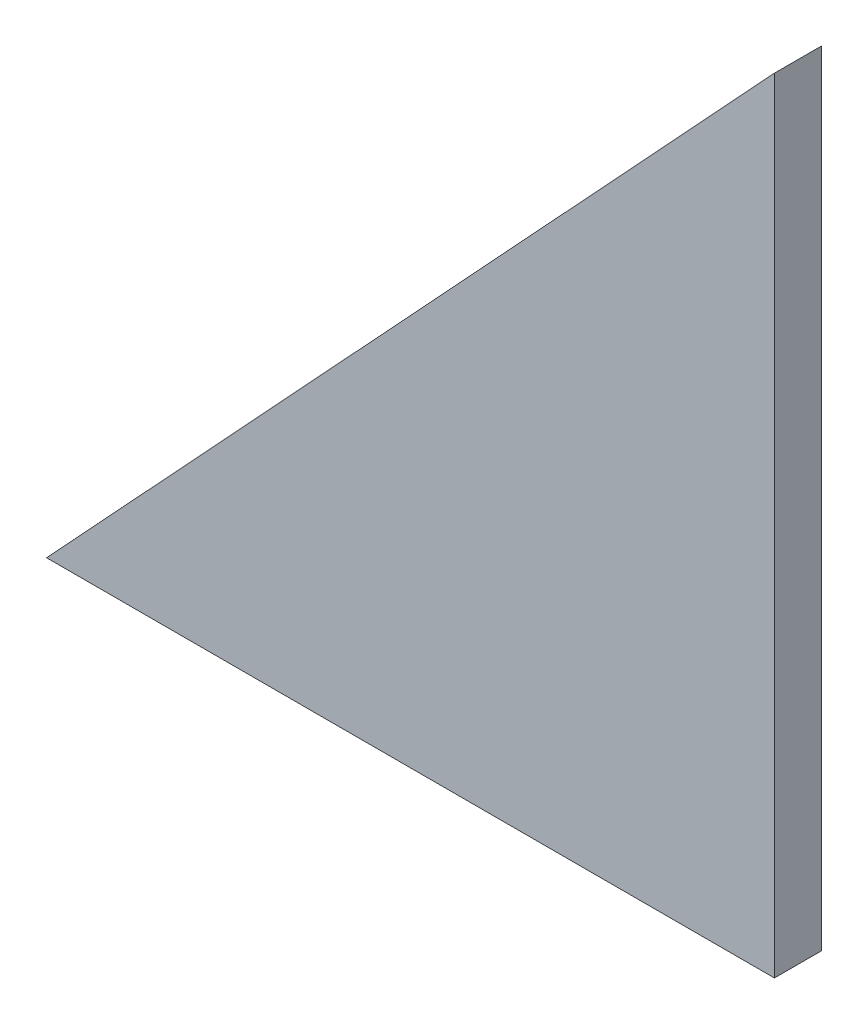
ISO-10303-21;
HEADER;
FILE_DESCRIPTION(('STEP AP214'),'2;1');
FILE_NAME('part.step','',(''),(''),'','','');
FILE_SCHEMA(('AUTOMOTIVE_DESIGN { 1 0 10303 214 1 1 1 1 }'));
ENDSEC;
DATA;
#1=APPLICATION_CONTEXT('core data for automotive mechanical design processes');
#2=APPLICATION_PROTOCOL_DEFINITION('international standard','automotive_design',2000,#1);
#3=PRODUCT_CONTEXT('',#1,'mechanical');
#4=PRODUCT('Part','Part','',(#3));
#5=PRODUCT_RELATED_PRODUCT_CATEGORY('part','',(#4));
#6=PRODUCT_DEFINITION_FORMATION('','',#4);
#7=PRODUCT_DEFINITION_CONTEXT('part definition',#1,'design');
#8=PRODUCT_DEFINITION('design','',#6,#7);
#9=PRODUCT_DEFINITION_SHAPE('','',#8);
#10=(LENGTH_UNIT() NAMED_UNIT(*) SI_UNIT(.MILLI.,.METRE.));
#11=(NAMED_UNIT(*) PLANE_ANGLE_UNIT() SI_UNIT($,.RADIAN.));
#12=(NAMED_UNIT(*) SI_UNIT($,.STERADIAN.) SOLID_ANGLE_UNIT());
#13=UNCERTAINTY_MEASURE_WITH_UNIT(LENGTH_MEASURE(1.E-05),#10,'distance_accuracy_value','');
#14=(GEOMETRIC_REPRESENTATION_CONTEXT(3) GLOBAL_UNCERTAINTY_ASSIGNED_CONTEXT((#13)) GLOBAL_UNIT_ASSIGNED_CONTEXT((#10,
#11,#12)) REPRESENTATION_CONTEXT('',''));
#15=CARTESIAN_POINT('',(0.,0.,0.));
#16=DIRECTION('',(0.,0.,1.));
#17=DIRECTION('',(1.,0.,0.));
#18=AXIS2_PLACEMENT_3D('',#15,#16,#17);
#19=CARTESIAN_POINT('',(0.,0.,0.5));
#20=DIRECTION('',(0.,-1.,0.));
#21=DIRECTION('',(1.,0.,0.));
#22=AXIS2_PLACEMENT_3D('',#19,#20,#21);
#23=PLANE('',#22);
#24=CARTESIAN_POINT('',(6.78,0.,-11.501504654096));
#25=DIRECTION('',(0.,-1.,0.));
#26=DIRECTION('',(1.,0.,0.));
#27=AXIS2_PLACEMENT_3D('',#24,#25,#26);
#28=CIRCLE('',#27,12.5);
#29=CARTESIAN_POINT('',(0.,0.,-0.999999999999994));
#30=VERTEX_POINT('',#29);
#31=CARTESIAN_POINT('',(-0.717993375170194,0.,-1.5));
#32=VERTEX_POINT('',#31);
#33=EDGE_CURVE('E52',#30,#32,#28,.T.);
#34=ORIENTED_EDGE('',*,*,#33,.F.);
#35=DIRECTION('',(0.,0.,-1.));
#36=VECTOR('',#35,1.);
#37=CARTESIAN_POINT('',(0.,0.,0.5));
#38=LINE('',#37,#36);
#39=CARTESIAN_POINT('',(0.,0.,0.5));
#40=VERTEX_POINT('',#39);
#41=EDGE_CURVE('E45',#40,#30,#38,.T.);
#42=ORIENTED_EDGE('',*,*,#41,.F.);
#43=DIRECTION('',(-1.,0.,0.));
#44=VECTOR('',#43,1.);
#45=CARTESIAN_POINT('',(0.,0.,0.5));
#46=LINE('',#45,#44);
#47=CARTESIAN_POINT('',(-23.22,0.,0.5));
#48=VERTEX_POINT('',#47);
#49=EDGE_CURVE('E103',#40,#48,#46,.T.);
#50=ORIENTED_EDGE('',*,*,#49,.T.);
#51=DIRECTION('',(0.,0.,-1.));
#52=VECTOR('',#51,1.);
#53=CARTESIAN_POINT('',(-23.22,0.,0.5));
#54=LINE('',#53,#52);
#55=CARTESIAN_POINT('',(-23.22,0.,-1.5));
#56=VERTEX_POINT('',#55);
#57=EDGE_CURVE('E94',#48,#56,#54,.T.);
#58=ORIENTED_EDGE('',*,*,#57,.T.);
#59=DIRECTION('',(-1.,0.,0.));
#60=VECTOR('',#59,1.);
#61=CARTESIAN_POINT('',(0.,0.,-1.5));
#62=LINE('',#61,#60);
#63=EDGE_CURVE('E70',#32,#56,#62,.T.);
#64=ORIENTED_EDGE('',*,*,#63,.F.);
#65=EDGE_LOOP('',(#34,#42,#50,#58,#64));
#66=FACE_BOUND('',#65,.T.);
#67=ADVANCED_FACE('F38',(#66),#23,.T.);
#68=CARTESIAN_POINT('',(0.,25.,0.5));
#69=DIRECTION('',(1.,0.,0.));
#70=DIRECTION('',(0.,1.,0.));
#71=AXIS2_PLACEMENT_3D('',#68,#69,#70);
#72=PLANE('',#71);
#73=DIRECTION('',(0.,-1.,0.));
#74=VECTOR('',#73,1.);
#75=CARTESIAN_POINT('',(0.,25.,-0.999999999999999));
#76=LINE('',#75,#74);
#77=CARTESIAN_POINT('',(0.,25.,-1.));
#78=VERTEX_POINT('',#77);
#79=EDGE_CURVE('E81',#78,#30,#76,.T.);
#80=ORIENTED_EDGE('',*,*,#79,.F.);
#81=DIRECTION('',(0.,0.,-1.));
#82=VECTOR('',#81,1.);
#83=CARTESIAN_POINT('',(0.,25.,0.5));
#84=LINE('',#83,#82);
#85=CARTESIAN_POINT('',(0.,25.,0.5));
#86=VERTEX_POINT('',#85);
#87=EDGE_CURVE('E92',#86,#78,#84,.T.);
#88=ORIENTED_EDGE('',*,*,#87,.F.);
#89=DIRECTION('',(0.,-1.,0.));
#90=VECTOR('',#89,1.);
#91=CARTESIAN_POINT('',(0.,25.,0.5));
#92=LINE('',#91,#90);
#93=EDGE_CURVE('E91',#86,#40,#92,.T.);
#94=ORIENTED_EDGE('',*,*,#93,.T.);
#95=ORIENTED_EDGE('',*,*,#41,.T.);
#96=EDGE_LOOP('',(#80,#88,#94,#95));
#97=FACE_BOUND('',#96,.T.);
#98=ADVANCED_FACE('F89',(#97),#72,.T.);
#99=CARTESIAN_POINT('',(-23.22,0.,0.5));
#100=DIRECTION('',(-0.732709977244616,0.680541026864799,0.));
#101=DIRECTION('',(-0.680541026864799,-0.732709977244616,0.));
#102=AXIS2_PLACEMENT_3D('',#99,#100,#101);
#103=PLANE('',#102);
#104=CARTESIAN_POINT('',(6.78000000000001,32.2997416020672,-11.501504654096));
#105=DIRECTION('',(-0.732709977244616,0.680541026864799,0.));
#106=DIRECTION('',(-0.680541026864799,-0.732709977244616,0.));
#107=AXIS2_PLACEMENT_3D('',#104,#105,#106);
#108=ELLIPSE('',#107,18.3677390584173,12.5);
#109=CARTESIAN_POINT('',(-0.71799337517019,24.2269666503336,-1.5));
#110=VERTEX_POINT('',#109);
#111=EDGE_CURVE('E83',#110,#78,#108,.T.);
#112=ORIENTED_EDGE('',*,*,#111,.F.);
#113=DIRECTION('',(0.680541026864799,0.732709977244616,0.));
#114=VECTOR('',#113,1.);
#115=CARTESIAN_POINT('',(-23.22,0.,-1.5));
#116=LINE('',#115,#114);
#117=EDGE_CURVE('E97',#56,#110,#116,.T.);
#118=ORIENTED_EDGE('',*,*,#117,.F.);
#119=ORIENTED_EDGE('',*,*,#57,.F.);
#120=DIRECTION('',(0.680541026864799,0.732709977244616,0.));
#121=VECTOR('',#120,1.);
#122=CARTESIAN_POINT('',(-23.22,0.,0.5));
#123=LINE('',#122,#121);
#124=EDGE_CURVE('E100',#48,#86,#123,.T.);
#125=ORIENTED_EDGE('',*,*,#124,.T.);
#126=ORIENTED_EDGE('',*,*,#87,.T.);
#127=EDGE_LOOP('',(#112,#118,#119,#125,#126));
#128=FACE_BOUND('',#127,.T.);
#129=ADVANCED_FACE('F111',(#128),#103,.T.);
#130=CARTESIAN_POINT('',(0.,0.,0.5));
#131=DIRECTION('',(0.,0.,1.));
#132=DIRECTION('',(1.,0.,0.));
#133=AXIS2_PLACEMENT_3D('',#130,#131,#132);
#134=PLANE('',#133);
#135=ORIENTED_EDGE('',*,*,#49,.F.);
#136=ORIENTED_EDGE('',*,*,#93,.F.);
#137=ORIENTED_EDGE('',*,*,#124,.F.);
#138=EDGE_LOOP('',(#135,#136,#137));
#139=FACE_BOUND('',#138,.T.);
#140=ADVANCED_FACE('F109',(#139),#134,.T.);
#141=CARTESIAN_POINT('',(0.,0.,-1.5));
#142=DIRECTION('',(0.,0.,1.));
#143=DIRECTION('',(1.,0.,0.));
#144=AXIS2_PLACEMENT_3D('',#141,#142,#143);
#145=PLANE('',#144);
#146=ORIENTED_EDGE('',*,*,#117,.T.);
#147=DIRECTION('',(0.,-1.,0.));
#148=VECTOR('',#147,1.);
#149=CARTESIAN_POINT('',(-0.717993375170187,25.,-1.5));
#150=LINE('',#149,#148);
#151=EDGE_CURVE('E11',#110,#32,#150,.T.);
#152=ORIENTED_EDGE('',*,*,#151,.T.);
#153=ORIENTED_EDGE('',*,*,#63,.T.);
#154=EDGE_LOOP('',(#146,#152,#153));
#155=FACE_BOUND('',#154,.T.);
#156=ADVANCED_FACE('F117',(#155),#145,.F.);
#157=CARTESIAN_POINT('',(6.78000000000001,25.,-11.501504654096));
#158=DIRECTION('',(0.,-1.,0.));
#159=DIRECTION('',(1.,0.,0.));
#160=AXIS2_PLACEMENT_3D('',#157,#158,#159);
#161=CYLINDRICAL_SURFACE('',#160,12.5);
#162=ORIENTED_EDGE('',*,*,#79,.T.);
#163=ORIENTED_EDGE('',*,*,#33,.T.);
#164=ORIENTED_EDGE('',*,*,#151,.F.);
#165=ORIENTED_EDGE('',*,*,#111,.T.);
#166=EDGE_LOOP('',(#162,#163,#164,#165));
#167=FACE_BOUND('',#166,.T.);
#168=ADVANCED_FACE('F82',(#167),#161,.F.);
#169=CLOSED_SHELL('',(#67,#98,#129,#140,#156,#168));
#170=MANIFOLD_SOLID_BREP('B2',#169);
#171=ADVANCED_BREP_SHAPE_REPRESENTATION('',(#18,#170),#14);
#172=SHAPE_DEFINITION_REPRESENTATION(#9,#171);
ENDSEC;
END-ISO-10303-21;
